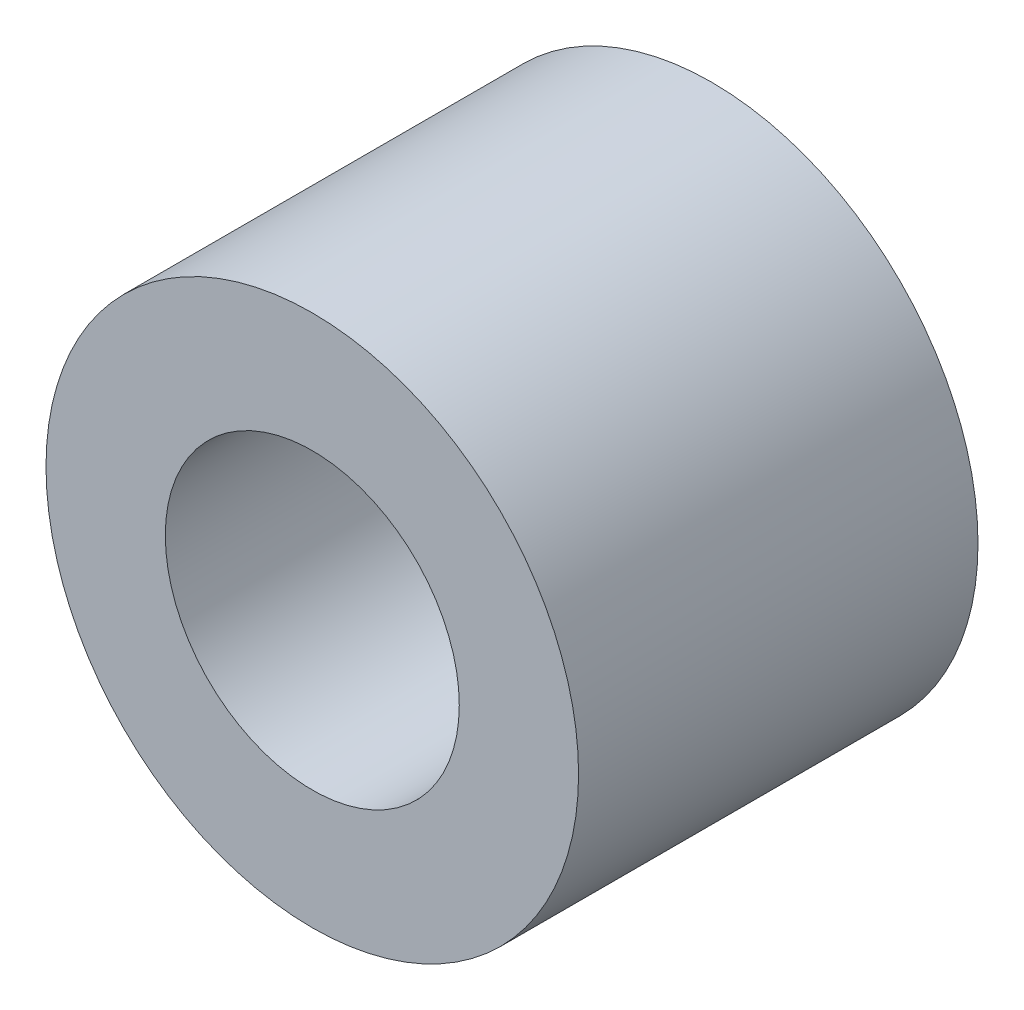
ISO-10303-21;
HEADER;
FILE_DESCRIPTION(('STEP AP214'),'2;1');
FILE_NAME('part.step','',(''),(''),'','','');
FILE_SCHEMA(('AUTOMOTIVE_DESIGN { 1 0 10303 214 1 1 1 1 }'));
ENDSEC;
DATA;
#1=APPLICATION_CONTEXT('core data for automotive mechanical design processes');
#2=APPLICATION_PROTOCOL_DEFINITION('international standard','automotive_design',2000,#1);
#3=PRODUCT_CONTEXT('',#1,'mechanical');
#4=PRODUCT('Part','Part','',(#3));
#5=PRODUCT_RELATED_PRODUCT_CATEGORY('part','',(#4));
#6=PRODUCT_DEFINITION_FORMATION('','',#4);
#7=PRODUCT_DEFINITION_CONTEXT('part definition',#1,'design');
#8=PRODUCT_DEFINITION('design','',#6,#7);
#9=PRODUCT_DEFINITION_SHAPE('','',#8);
#10=(LENGTH_UNIT() NAMED_UNIT(*) SI_UNIT(.MILLI.,.METRE.));
#11=(NAMED_UNIT(*) PLANE_ANGLE_UNIT() SI_UNIT($,.RADIAN.));
#12=(NAMED_UNIT(*) SI_UNIT($,.STERADIAN.) SOLID_ANGLE_UNIT());
#13=UNCERTAINTY_MEASURE_WITH_UNIT(LENGTH_MEASURE(1.E-05),#10,'distance_accuracy_value','');
#14=(GEOMETRIC_REPRESENTATION_CONTEXT(3) GLOBAL_UNCERTAINTY_ASSIGNED_CONTEXT((#13)) GLOBAL_UNIT_ASSIGNED_CONTEXT((#10,
#11,#12)) REPRESENTATION_CONTEXT('',''));
#15=CARTESIAN_POINT('',(0.,0.,0.));
#16=DIRECTION('',(0.,0.,1.));
#17=DIRECTION('',(1.,0.,0.));
#18=AXIS2_PLACEMENT_3D('',#15,#16,#17);
#19=CARTESIAN_POINT('',(0.,0.,-2.38125));
#20=DIRECTION('',(0.,0.,1.));
#21=DIRECTION('',(1.,0.,0.));
#22=AXIS2_PLACEMENT_3D('',#19,#20,#21);
#23=CYLINDRICAL_SURFACE('',#22,3.175);
#24=CARTESIAN_POINT('',(0.,0.,-2.38125));
#25=DIRECTION('',(0.,0.,1.));
#26=DIRECTION('',(1.,0.,0.));
#27=AXIS2_PLACEMENT_3D('',#24,#25,#26);
#28=CIRCLE('',#27,3.175);
#29=CARTESIAN_POINT('',(3.175,0.,-2.38125));
#30=VERTEX_POINT('',#29);
#31=EDGE_CURVE('E10',#30,#30,#28,.T.);
#32=ORIENTED_EDGE('',*,*,#31,.T.);
#33=EDGE_LOOP('',(#32));
#34=FACE_BOUND('',#33,.T.);
#35=CARTESIAN_POINT('',(0.,0.,2.38125));
#36=DIRECTION('',(0.,0.,1.));
#37=DIRECTION('',(1.,0.,0.));
#38=AXIS2_PLACEMENT_3D('',#35,#36,#37);
#39=CIRCLE('',#38,3.175);
#40=CARTESIAN_POINT('',(3.175,0.,2.38125));
#41=VERTEX_POINT('',#40);
#42=EDGE_CURVE('E35',#41,#41,#39,.T.);
#43=ORIENTED_EDGE('',*,*,#42,.F.);
#44=EDGE_LOOP('',(#43));
#45=FACE_BOUND('',#44,.T.);
#46=ADVANCED_FACE('F32',(#34,#45),#23,.T.);
#47=CARTESIAN_POINT('',(0.,0.,-2.38125));
#48=DIRECTION('',(0.,0.,1.));
#49=DIRECTION('',(1.,0.,0.));
#50=AXIS2_PLACEMENT_3D('',#47,#48,#49);
#51=PLANE('',#50);
#52=CARTESIAN_POINT('',(0.,0.,-2.38125));
#53=DIRECTION('',(0.,0.,1.));
#54=DIRECTION('',(1.,0.,0.));
#55=AXIS2_PLACEMENT_3D('',#52,#53,#54);
#56=CIRCLE('',#55,1.7526);
#57=CARTESIAN_POINT('',(1.7526,0.,-2.38125));
#58=VERTEX_POINT('',#57);
#59=EDGE_CURVE('E42',#58,#58,#56,.T.);
#60=ORIENTED_EDGE('',*,*,#59,.T.);
#61=EDGE_LOOP('',(#60));
#62=FACE_BOUND('',#61,.T.);
#63=ORIENTED_EDGE('',*,*,#31,.F.);
#64=EDGE_LOOP('',(#63));
#65=FACE_BOUND('',#64,.T.);
#66=ADVANCED_FACE('F50',(#62,#65),#51,.F.);
#67=CARTESIAN_POINT('',(0.,0.,2.38125));
#68=DIRECTION('',(0.,0.,1.));
#69=DIRECTION('',(1.,0.,0.));
#70=AXIS2_PLACEMENT_3D('',#67,#68,#69);
#71=PLANE('',#70);
#72=CARTESIAN_POINT('',(0.,0.,2.38125));
#73=DIRECTION('',(0.,0.,1.));
#74=DIRECTION('',(1.,0.,0.));
#75=AXIS2_PLACEMENT_3D('',#72,#73,#74);
#76=CIRCLE('',#75,1.7526);
#77=CARTESIAN_POINT('',(1.7526,0.,2.38125));
#78=VERTEX_POINT('',#77);
#79=EDGE_CURVE('E44',#78,#78,#76,.T.);
#80=ORIENTED_EDGE('',*,*,#79,.F.);
#81=EDGE_LOOP('',(#80));
#82=FACE_BOUND('',#81,.T.);
#83=ORIENTED_EDGE('',*,*,#42,.T.);
#84=EDGE_LOOP('',(#83));
#85=FACE_BOUND('',#84,.T.);
#86=ADVANCED_FACE('F56',(#82,#85),#71,.T.);
#87=CARTESIAN_POINT('',(0.,0.,-2.38125));
#88=DIRECTION('',(0.,0.,1.));
#89=DIRECTION('',(1.,0.,0.));
#90=AXIS2_PLACEMENT_3D('',#87,#88,#89);
#91=CYLINDRICAL_SURFACE('',#90,1.7526);
#92=ORIENTED_EDGE('',*,*,#59,.F.);
#93=EDGE_LOOP('',(#92));
#94=FACE_BOUND('',#93,.T.);
#95=ORIENTED_EDGE('',*,*,#79,.T.);
#96=EDGE_LOOP('',(#95));
#97=FACE_BOUND('',#96,.T.);
#98=ADVANCED_FACE('F53',(#94,#97),#91,.F.);
#99=CLOSED_SHELL('',(#46,#66,#86,#98));
#100=MANIFOLD_SOLID_BREP('B2',#99);
#101=ADVANCED_BREP_SHAPE_REPRESENTATION('',(#18,#100),#14);
#102=SHAPE_DEFINITION_REPRESENTATION(#9,#101);
ENDSEC;
END-ISO-10303-21;
